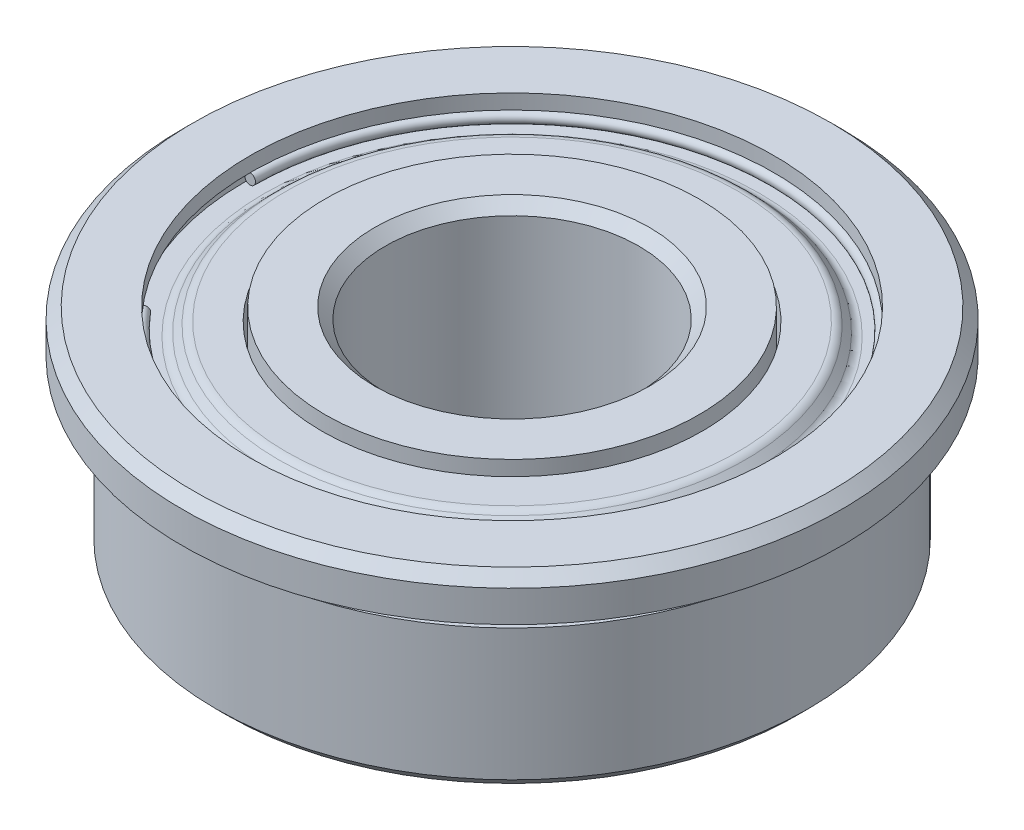
ISO-10303-21;
HEADER;
FILE_DESCRIPTION(('STEP AP214'),'2;1');
FILE_NAME('part.step','',(''),(''),'','','');
FILE_SCHEMA(('AUTOMOTIVE_DESIGN { 1 0 10303 214 1 1 1 1 }'));
ENDSEC;
DATA;
#1=APPLICATION_CONTEXT('core data for automotive mechanical design processes');
#2=APPLICATION_PROTOCOL_DEFINITION('international standard','automotive_design',2000,#1);
#3=PRODUCT_CONTEXT('',#1,'mechanical');
#4=PRODUCT('Part','Part','',(#3));
#5=PRODUCT_RELATED_PRODUCT_CATEGORY('part','',(#4));
#6=PRODUCT_DEFINITION_FORMATION('','',#4);
#7=PRODUCT_DEFINITION_CONTEXT('part definition',#1,'design');
#8=PRODUCT_DEFINITION('design','',#6,#7);
#9=PRODUCT_DEFINITION_SHAPE('','',#8);
#10=(LENGTH_UNIT() NAMED_UNIT(*) SI_UNIT(.MILLI.,.METRE.));
#11=(NAMED_UNIT(*) PLANE_ANGLE_UNIT() SI_UNIT($,.RADIAN.));
#12=(NAMED_UNIT(*) SI_UNIT($,.STERADIAN.) SOLID_ANGLE_UNIT());
#13=UNCERTAINTY_MEASURE_WITH_UNIT(LENGTH_MEASURE(1.E-05),#10,'distance_accuracy_value','');
#14=(GEOMETRIC_REPRESENTATION_CONTEXT(3) GLOBAL_UNCERTAINTY_ASSIGNED_CONTEXT((#13)) GLOBAL_UNIT_ASSIGNED_CONTEXT((#10,
#11,#12)) REPRESENTATION_CONTEXT('',''));
#15=CARTESIAN_POINT('',(0.,0.,0.));
#16=DIRECTION('',(0.,0.,1.));
#17=DIRECTION('',(1.,0.,0.));
#18=AXIS2_PLACEMENT_3D('',#15,#16,#17);
#19=CARTESIAN_POINT('',(-6.2,0.431800000000002,0.));
#20=DIRECTION('',(0.,0.,1.));
#21=DIRECTION('',(1.,0.,0.));
#22=AXIS2_PLACEMENT_3D('',#19,#20,#21);
#23=PLANE('',#22);
#24=CARTESIAN_POINT('',(-6.073,0.431800000000002,0.));
#25=CARTESIAN_POINT('',(-6.07300899992696,0.417569642926092,0.));
#26=CARTESIAN_POINT('',(-6.07543449231307,0.403251719708381,0.));
#27=CARTESIAN_POINT('',(-6.08488379429475,0.376272860189244,0.));
#28=CARTESIAN_POINT('',(-6.09190760389031,0.363611923887818,0.));
#29=CARTESIAN_POINT('',(-6.10975126434134,0.341316101747298,0.));
#30=CARTESIAN_POINT('',(-6.1205711151969,0.331681215908281,0.));
#31=CARTESIAN_POINT('',(-6.14478979269765,0.316539316925007,0.));
#32=CARTESIAN_POINT('',(-6.15818861934284,0.311032303780751,0.));
#33=CARTESIAN_POINT('',(-6.18605386450994,0.304763137356642,0.));
#34=CARTESIAN_POINT('',(-6.20052028303185,0.304000984076788,0.));
#35=CARTESIAN_POINT('',(-6.22889001376166,0.307307449590691,0.));
#36=CARTESIAN_POINT('',(-6.24279332596954,0.311376068384447,0.));
#37=CARTESIAN_POINT('',(-6.26846899590067,0.323889318093972,0.));
#38=CARTESIAN_POINT('',(-6.2802413536239,0.332333949009741,0.));
#39=CARTESIAN_POINT('',(-6.30032901054135,0.35263138586272,0.));
#40=CARTESIAN_POINT('',(-6.30864430973557,0.36448419179993,0.));
#41=CARTESIAN_POINT('',(-6.32087615792845,0.390320794880103,0.));
#42=CARTESIAN_POINT('',(-6.32479270692711,0.404304592023067,0.));
#43=CARTESIAN_POINT('',(-6.32676833023764,0.422889694465366,0.));
#44=CARTESIAN_POINT('',(-6.32700282036117,0.427340547537076,0.));
#45=CARTESIAN_POINT('',(-6.32699100007304,0.446030357073912,0.));
#46=CARTESIAN_POINT('',(-6.32456550768693,0.460348280291623,0.));
#47=CARTESIAN_POINT('',(-6.31511620570525,0.48732713981076,0.));
#48=CARTESIAN_POINT('',(-6.30809239610969,0.499988076112186,0.));
#49=CARTESIAN_POINT('',(-6.29024873565866,0.522283898252706,0.));
#50=CARTESIAN_POINT('',(-6.27942888480311,0.531918784091724,0.));
#51=CARTESIAN_POINT('',(-6.25521020730236,0.547060683074997,0.));
#52=CARTESIAN_POINT('',(-6.24181138065717,0.552567696219253,0.));
#53=CARTESIAN_POINT('',(-6.21394613549006,0.558836862643363,0.));
#54=CARTESIAN_POINT('',(-6.19947971696815,0.559599015923216,0.));
#55=CARTESIAN_POINT('',(-6.17110998623835,0.556292550409314,0.));
#56=CARTESIAN_POINT('',(-6.15720667403046,0.552223931615557,0.));
#57=CARTESIAN_POINT('',(-6.13153100409934,0.539710681906032,0.));
#58=CARTESIAN_POINT('',(-6.1197586463761,0.531266050990263,0.));
#59=CARTESIAN_POINT('',(-6.09967098945865,0.510968614137284,0.));
#60=CARTESIAN_POINT('',(-6.09135569026443,0.499115808200074,0.));
#61=CARTESIAN_POINT('',(-6.07912384207156,0.473279205119901,0.));
#62=CARTESIAN_POINT('',(-6.0752072930729,0.459295407976938,0.));
#63=CARTESIAN_POINT('',(-6.07323166976236,0.440710305534639,0.));
#64=CARTESIAN_POINT('',(-6.07299717963884,0.436259452462929,0.));
#65=CARTESIAN_POINT('',(-6.073,0.431800000000002,0.));
#66=B_SPLINE_CURVE_WITH_KNOTS('',3,(#24,#25,#26,#27,#28,#29,#30,#31,#32,#33,#34,#35,#36,#37,#38,
#39,#40,#41,#42,#43,#44,#45,#46,#47,#48,#49,#50,#51,#52,#53,#54,#55,#56,#57,#58,#59,#60,#61,#62,
#63,#64,#65),.UNSPECIFIED.,.T.,.F.,(4,2,2,2,2,2,2,2,2,2,2,2,2,2,2,2,2,2,2,2,4),(0.,
0.0426429642402332,0.0852859284804665,0.127928892721776,0.170571856963085,0.213214821204395,
0.255857785445704,0.298500749687013,0.341143713928322,0.383786678169631,0.397149959984692,
0.439792924224925,0.482435888465158,0.525078852706467,0.567721816947776,0.610364781189086,
0.653007745430395,0.695650709671705,0.738293673913014,0.780936638154322,0.794299919969383),.UNSPECIFIED.);
#67=CARTESIAN_POINT('',(-6.073,0.431800000000002,0.));
#68=VERTEX_POINT('',#67);
#69=EDGE_CURVE('P0_E18',#68,#68,#66,.T.);
#70=ORIENTED_EDGE('',*,*,#69,.F.);
#71=EDGE_LOOP('',(#70));
#72=FACE_BOUND('',#71,.T.);
#73=ADVANCED_FACE('P0_F14',(#72),#23,.T.);
#74=CARTESIAN_POINT('',(-4.74947554733771,0.431800000000002,3.98528318005649));
#75=DIRECTION('',(0.64278760968653,0.,0.766044443118986));
#76=DIRECTION('',(0.766044443118986,0.,-0.64278760968653));
#77=AXIS2_PLACEMENT_3D('',#74,#75,#76);
#78=PLANE('',#77);
#79=CARTESIAN_POINT('',(-4.84676319161383,0.431800000000002,4.06691720648668));
#80=CARTESIAN_POINT('',(-4.84675629726979,0.417569642926092,4.06691142144514));
#81=CARTESIAN_POINT('',(-4.84489826230558,0.403251719708381,4.06535234499196));
#82=CARTESIAN_POINT('',(-4.83765967703116,0.376272860189244,4.05927845075795));
#83=CARTESIAN_POINT('',(-4.83227912672096,0.363611923887819,4.05476363297712));
#84=CARTESIAN_POINT('',(-4.81861008978755,0.341316101747299,4.04329394912775));
#85=CARTESIAN_POINT('',(-4.81032160316427,0.331681215908281,4.03633908305914));
#86=CARTESIAN_POINT('',(-4.79176901984513,0.316539316925007,4.02077161723867));
#87=CARTESIAN_POINT('',(-4.78150492314927,0.311032303780751,4.0121590174868));
#88=CARTESIAN_POINT('',(-4.76015890693286,0.304763137356642,3.99424758315251));
#89=CARTESIAN_POINT('',(-4.74907698741231,0.304000984076788,3.98494874857008));
#90=CARTESIAN_POINT('',(-4.72734451283397,0.307307449590691,3.96671303716682));
#91=CARTESIAN_POINT('',(-4.71669395777617,0.311376068384447,3.95777616034599));
#92=CARTESIAN_POINT('',(-4.69702525350207,0.323889318093972,3.94127215784386));
#93=CARTESIAN_POINT('',(-4.68800710428578,0.332333949009742,3.93370503216257));
#94=CARTESIAN_POINT('',(-4.67261906632888,0.352631385862721,3.9207929351884));
#95=CARTESIAN_POINT('',(-4.66624917758828,0.36448419179993,3.91544796389552));
#96=CARTESIAN_POINT('',(-4.65687903825105,0.390320794880103,3.90758548343357));
#97=CARTESIAN_POINT('',(-4.65387878765443,0.404304592023067,3.9050679742645));
#98=CARTESIAN_POINT('',(-4.6523653723957,0.422889694465366,3.90379806807908));
#99=CARTESIAN_POINT('',(-4.6521857425396,0.427340547537076,3.90364734073309));
#100=CARTESIAN_POINT('',(-4.65219479740564,0.446030357073912,3.90365493866783));
#101=CARTESIAN_POINT('',(-4.65405283236985,0.460348280291623,3.90521401512102));
#102=CARTESIAN_POINT('',(-4.66129141764427,0.48732713981076,3.91128790935503));
#103=CARTESIAN_POINT('',(-4.66667196795447,0.499988076112186,3.91580272713585));
#104=CARTESIAN_POINT('',(-4.68034100488788,0.522283898252706,3.92727241098522));
#105=CARTESIAN_POINT('',(-4.68862949151116,0.531918784091723,3.93422727705383));
#106=CARTESIAN_POINT('',(-4.7071820748303,0.547060683074997,3.94979474287431));
#107=CARTESIAN_POINT('',(-4.71744617152616,0.552567696219253,3.95840734262617));
#108=CARTESIAN_POINT('',(-4.73879218774257,0.558836862643363,3.97631877696047));
#109=CARTESIAN_POINT('',(-4.74987410726311,0.559599015923216,3.98561761154289));
#110=CARTESIAN_POINT('',(-4.77160658184146,0.556292550409314,4.00385332294615));
#111=CARTESIAN_POINT('',(-4.78225713689926,0.552223931615557,4.01279019976699));
#112=CARTESIAN_POINT('',(-4.80192584117335,0.539710681906032,4.02929420226911));
#113=CARTESIAN_POINT('',(-4.81094399038965,0.531266050990263,4.03686132795041));
#114=CARTESIAN_POINT('',(-4.82633202834654,0.510968614137284,4.04977342492458));
#115=CARTESIAN_POINT('',(-4.83270191708715,0.499115808200074,4.05511839621746));
#116=CARTESIAN_POINT('',(-4.84207205642437,0.473279205119901,4.0629808766794));
#117=CARTESIAN_POINT('',(-4.845072307021,0.459295407976938,4.06549838584847));
#118=CARTESIAN_POINT('',(-4.84658572227973,0.440710305534639,4.06676829203389));
#119=CARTESIAN_POINT('',(-4.84676535213582,0.436259452462929,4.06691901937989));
#120=CARTESIAN_POINT('',(-4.84676319161383,0.431800000000002,4.06691720648668));
#121=B_SPLINE_CURVE_WITH_KNOTS('',3,(#79,#80,#81,#82,#83,#84,#85,#86,#87,#88,#89,#90,#91,#92,
#93,#94,#95,#96,#97,#98,#99,#100,#101,#102,#103,#104,#105,#106,#107,#108,#109,#110,#111,#112,
#113,#114,#115,#116,#117,#118,#119,#120),.UNSPECIFIED.,.T.,.F.,(4,2,2,2,2,2,2,2,2,2,2,2,2,2,2,2,
2,2,2,2,4),(0.,0.0426429642402333,0.0852859284804668,0.127928892721776,0.170571856963085,
0.213214821204395,0.255857785445705,0.298500749687014,0.341143713928322,0.383786678169631,
0.397149959984691,0.439792924224925,0.482435888465158,0.525078852706467,0.567721816947775,
0.610364781189085,0.653007745430396,0.695650709671705,0.738293673913015,0.780936638154323,
0.794299919969383),.UNSPECIFIED.);
#122=CARTESIAN_POINT('',(-4.84676319161383,0.431800000000002,4.06691720648668));
#123=VERTEX_POINT('',#122);
#124=EDGE_CURVE('P0_E9',#123,#123,#121,.T.);
#125=ORIENTED_EDGE('',*,*,#124,.F.);
#126=EDGE_LOOP('',(#125));
#127=FACE_BOUND('',#126,.T.);
#128=ADVANCED_FACE('P0_F32',(#127),#78,.F.);
#129=CARTESIAN_POINT('',(0.,0.431800000000002,0.));
#130=DIRECTION('',(0.,-1.,0.));
#131=DIRECTION('',(0.,0.,1.));
#132=AXIS2_PLACEMENT_3D('',#129,#130,#131);
#133=TOROIDAL_SURFACE('',#132,6.2,0.127000000000001);
#134=ORIENTED_EDGE('',*,*,#124,.T.);
#135=EDGE_LOOP('',(#134));
#136=FACE_BOUND('',#135,.T.);
#137=ORIENTED_EDGE('',*,*,#69,.T.);
#138=EDGE_LOOP('',(#137));
#139=FACE_BOUND('',#138,.T.);
#140=ADVANCED_FACE('P0_F34',(#136,#139),#133,.T.);
#141=CLOSED_SHELL('',(#73,#128,#140));
#142=MANIFOLD_SOLID_BREP('P0_B1',#141);
#143=CARTESIAN_POINT('',(0.,5.,0.));
#144=DIRECTION('',(0.,1.,0.));
#145=DIRECTION('',(0.,0.,1.));
#146=AXIS2_PLACEMENT_3D('',#143,#144,#145);
#147=PLANE('',#146);
#148=CARTESIAN_POINT('',(0.,5.,0.));
#149=DIRECTION('',(0.,1.,0.));
#150=DIRECTION('',(0.,0.,1.));
#151=AXIS2_PLACEMENT_3D('',#148,#149,#150);
#152=CIRCLE('',#151,4.425);
#153=CARTESIAN_POINT('',(0.,5.,4.425));
#154=VERTEX_POINT('',#153);
#155=EDGE_CURVE('P1_E380',#154,#154,#152,.F.);
#156=ORIENTED_EDGE('',*,*,#155,.F.);
#157=EDGE_LOOP('',(#156));
#158=FACE_BOUND('',#157,.T.);
#159=CARTESIAN_POINT('',(0.,5.0000000000523,0.));
#160=DIRECTION('',(0.,1.,0.));
#161=DIRECTION('',(0.,0.,1.));
#162=AXIS2_PLACEMENT_3D('',#159,#160,#161);
#163=CIRCLE('',#162,3.25399999996989);
#164=CARTESIAN_POINT('',(0.,5.0000000000523,3.25399999996989));
#165=VERTEX_POINT('',#164);
#166=EDGE_CURVE('P1_E378',#165,#165,#163,.F.);
#167=ORIENTED_EDGE('',*,*,#166,.T.);
#168=EDGE_LOOP('',(#167));
#169=FACE_BOUND('',#168,.T.);
#170=ADVANCED_FACE('P1_F17',(#158,#169),#147,.T.);
#171=CARTESIAN_POINT('',(0.,4.7,0.));
#172=DIRECTION('',(0.,1.,0.));
#173=DIRECTION('',(0.,0.,1.));
#174=AXIS2_PLACEMENT_3D('',#171,#172,#173);
#175=CYLINDRICAL_SURFACE('',#174,4.425);
#176=CARTESIAN_POINT('',(0.,3.43,0.));
#177=DIRECTION('',(0.,1.,0.));
#178=DIRECTION('',(0.,0.,1.));
#179=AXIS2_PLACEMENT_3D('',#176,#177,#178);
#180=CIRCLE('',#179,4.425);
#181=CARTESIAN_POINT('',(0.,3.43,4.425));
#182=VERTEX_POINT('',#181);
#183=EDGE_CURVE('P1_E375',#182,#182,#180,.F.);
#184=ORIENTED_EDGE('',*,*,#183,.F.);
#185=EDGE_LOOP('',(#184));
#186=FACE_BOUND('',#185,.T.);
#187=ORIENTED_EDGE('',*,*,#155,.T.);
#188=EDGE_LOOP('',(#187));
#189=FACE_BOUND('',#188,.T.);
#190=ADVANCED_FACE('P1_F128',(#186,#189),#175,.T.);
#191=CARTESIAN_POINT('',(0.,5.0000000000523,0.));
#192=DIRECTION('',(0.,1.,0.));
#193=DIRECTION('',(0.,0.,1.));
#194=AXIS2_PLACEMENT_3D('',#191,#192,#193);
#195=CONICAL_SURFACE('',#194,3.25399999996989,0.785398163397448);
#196=ORIENTED_EDGE('',*,*,#166,.F.);
#197=EDGE_LOOP('',(#196));
#198=FACE_BOUND('',#197,.T.);
#199=CARTESIAN_POINT('',(0.,4.746,0.));
#200=DIRECTION('',(0.,1.,0.));
#201=DIRECTION('',(0.,0.,1.));
#202=AXIS2_PLACEMENT_3D('',#199,#200,#201);
#203=CIRCLE('',#202,3.);
#204=CARTESIAN_POINT('',(0.,4.746,3.));
#205=VERTEX_POINT('',#204);
#206=EDGE_CURVE('P1_E374',#205,#205,#203,.F.);
#207=ORIENTED_EDGE('',*,*,#206,.T.);
#208=EDGE_LOOP('',(#207));
#209=FACE_BOUND('',#208,.T.);
#210=ADVANCED_FACE('P1_F125',(#198,#209),#195,.F.);
#211=CARTESIAN_POINT('',(0.,3.43,0.));
#212=DIRECTION('',(0.,1.,0.));
#213=DIRECTION('',(0.,0.,1.));
#214=AXIS2_PLACEMENT_3D('',#211,#212,#213);
#215=PLANE('',#214);
#216=CARTESIAN_POINT('',(0.,3.43,0.));
#217=DIRECTION('',(0.,1.,0.));
#218=DIRECTION('',(0.,0.,1.));
#219=AXIS2_PLACEMENT_3D('',#216,#217,#218);
#220=CIRCLE('',#219,4.5012);
#221=CARTESIAN_POINT('',(0.,3.43,4.5012));
#222=VERTEX_POINT('',#221);
#223=EDGE_CURVE('P1_E371',#222,#222,#220,.T.);
#224=ORIENTED_EDGE('',*,*,#223,.T.);
#225=EDGE_LOOP('',(#224));
#226=FACE_BOUND('',#225,.T.);
#227=ORIENTED_EDGE('',*,*,#183,.T.);
#228=EDGE_LOOP('',(#227));
#229=FACE_BOUND('',#228,.T.);
#230=ADVANCED_FACE('P1_F121',(#226,#229),#215,.T.);
#231=CARTESIAN_POINT('',(0.,0.,0.));
#232=DIRECTION('',(0.,1.,0.));
#233=DIRECTION('',(0.,0.,1.));
#234=AXIS2_PLACEMENT_3D('',#231,#232,#233);
#235=CYLINDRICAL_SURFACE('',#234,3.);
#236=ORIENTED_EDGE('',*,*,#206,.F.);
#237=EDGE_LOOP('',(#236));
#238=FACE_BOUND('',#237,.T.);
#239=CARTESIAN_POINT('',(0.,0.253999999983989,0.));
#240=DIRECTION('',(0.,-1.,0.));
#241=DIRECTION('',(0.,0.,-1.));
#242=AXIS2_PLACEMENT_3D('',#239,#240,#241);
#243=CIRCLE('',#242,3.00000000004275);
#244=CARTESIAN_POINT('',(0.,0.253999999983989,-3.00000000004275));
#245=VERTEX_POINT('',#244);
#246=EDGE_CURVE('P1_E78',#245,#245,#243,.T.);
#247=ORIENTED_EDGE('',*,*,#246,.T.);
#248=EDGE_LOOP('',(#247));
#249=FACE_BOUND('',#248,.T.);
#250=ADVANCED_FACE('P1_F117',(#238,#249),#235,.F.);
#251=CARTESIAN_POINT('',(0.,3.43,0.));
#252=DIRECTION('',(0.,1.,0.));
#253=DIRECTION('',(0.,0.,1.));
#254=AXIS2_PLACEMENT_3D('',#251,#252,#253);
#255=CYLINDRICAL_SURFACE('',#254,4.5012);
#256=CARTESIAN_POINT('',(0.,4.7,0.));
#257=DIRECTION('',(0.,1.,0.));
#258=DIRECTION('',(0.,0.,1.));
#259=AXIS2_PLACEMENT_3D('',#256,#257,#258);
#260=CIRCLE('',#259,4.5012);
#261=CARTESIAN_POINT('',(0.,4.7,4.5012));
#262=VERTEX_POINT('',#261);
#263=EDGE_CURVE('P1_E368',#262,#262,#260,.F.);
#264=ORIENTED_EDGE('',*,*,#263,.F.);
#265=EDGE_LOOP('',(#264));
#266=FACE_BOUND('',#265,.T.);
#267=ORIENTED_EDGE('',*,*,#223,.F.);
#268=EDGE_LOOP('',(#267));
#269=FACE_BOUND('',#268,.T.);
#270=ADVANCED_FACE('P1_F113',(#266,#269),#255,.F.);
#271=CARTESIAN_POINT('',(0.,-5.6843418860808E-11,0.));
#272=DIRECTION('',(0.,-1.,0.));
#273=DIRECTION('',(0.,0.,-1.));
#274=AXIS2_PLACEMENT_3D('',#271,#272,#273);
#275=CONICAL_SURFACE('',#274,3.25400000008358,0.785398163397448);
#276=CARTESIAN_POINT('',(0.,0.,0.));
#277=DIRECTION('',(0.,-1.,0.));
#278=DIRECTION('',(0.,0.,-1.));
#279=AXIS2_PLACEMENT_3D('',#276,#277,#278);
#280=CIRCLE('',#279,3.25400000002674);
#281=CARTESIAN_POINT('',(0.,0.,-3.25400000002674));
#282=VERTEX_POINT('',#281);
#283=EDGE_CURVE('P1_E64',#282,#282,#280,.T.);
#284=ORIENTED_EDGE('',*,*,#283,.T.);
#285=EDGE_LOOP('',(#284));
#286=FACE_BOUND('',#285,.T.);
#287=ORIENTED_EDGE('',*,*,#246,.F.);
#288=EDGE_LOOP('',(#287));
#289=FACE_BOUND('',#288,.T.);
#290=ADVANCED_FACE('P1_F108',(#286,#289),#275,.F.);
#291=CARTESIAN_POINT('',(0.,4.7,0.));
#292=DIRECTION('',(0.,1.,0.));
#293=DIRECTION('',(0.,0.,1.));
#294=AXIS2_PLACEMENT_3D('',#291,#292,#293);
#295=PLANE('',#294);
#296=ORIENTED_EDGE('',*,*,#263,.T.);
#297=EDGE_LOOP('',(#296));
#298=FACE_BOUND('',#297,.T.);
#299=CARTESIAN_POINT('',(0.,4.7,0.));
#300=DIRECTION('',(0.,-1.,0.));
#301=DIRECTION('',(0.,0.,-1.));
#302=AXIS2_PLACEMENT_3D('',#299,#300,#301);
#303=CIRCLE('',#302,5.34478975515724);
#304=CARTESIAN_POINT('',(0.,4.7,-5.34478975515724));
#305=VERTEX_POINT('',#304);
#306=CARTESIAN_POINT('',(0.,4.7,5.34478975515724));
#307=VERTEX_POINT('',#306);
#308=EDGE_CURVE('P1_E62',#305,#307,#303,.T.);
#309=ORIENTED_EDGE('',*,*,#308,.F.);
#310=CARTESIAN_POINT('',(0.,4.7,0.));
#311=DIRECTION('',(0.,-1.,0.));
#312=DIRECTION('',(0.,0.,1.));
#313=AXIS2_PLACEMENT_3D('',#310,#311,#312);
#314=CIRCLE('',#313,5.34478975515724);
#315=EDGE_CURVE('P1_E57',#307,#305,#314,.T.);
#316=ORIENTED_EDGE('',*,*,#315,.F.);
#317=EDGE_LOOP('',(#309,#316));
#318=FACE_BOUND('',#317,.T.);
#319=ADVANCED_FACE('P1_F61',(#298,#318),#295,.T.);
#320=CARTESIAN_POINT('',(0.,0.,0.));
#321=DIRECTION('',(0.,1.,0.));
#322=DIRECTION('',(0.,0.,1.));
#323=AXIS2_PLACEMENT_3D('',#320,#321,#322);
#324=PLANE('',#323);
#325=CARTESIAN_POINT('',(0.,0.,0.));
#326=DIRECTION('',(0.,-1.,0.));
#327=DIRECTION('',(0.,0.,-1.));
#328=AXIS2_PLACEMENT_3D('',#325,#326,#327);
#329=CIRCLE('',#328,4.425);
#330=CARTESIAN_POINT('',(0.,0.,-4.425));
#331=VERTEX_POINT('',#330);
#332=EDGE_CURVE('P1_E70',#331,#331,#329,.F.);
#333=ORIENTED_EDGE('',*,*,#332,.F.);
#334=EDGE_LOOP('',(#333));
#335=FACE_BOUND('',#334,.T.);
#336=ORIENTED_EDGE('',*,*,#283,.F.);
#337=EDGE_LOOP('',(#336));
#338=FACE_BOUND('',#337,.T.);
#339=ADVANCED_FACE('P1_F91',(#335,#338),#324,.F.);
#340=CARTESIAN_POINT('',(0.,4.446,0.));
#341=DIRECTION('',(0.,1.,0.));
#342=DIRECTION('',(0.,0.,1.));
#343=AXIS2_PLACEMENT_3D('',#340,#341,#342);
#344=TOROIDAL_SURFACE('',#343,5.34478975515723,0.254);
#345=ORIENTED_EDGE('',*,*,#315,.T.);
#346=ORIENTED_EDGE('',*,*,#308,.T.);
#347=EDGE_LOOP('',(#345,#346));
#348=FACE_BOUND('',#347,.T.);
#349=CARTESIAN_POINT('',(0.,4.62560512232812,0.));
#350=DIRECTION('',(0.,-1.,0.));
#351=DIRECTION('',(0.,0.,-1.));
#352=AXIS2_PLACEMENT_3D('',#349,#350,#351);
#353=CIRCLE('',#352,5.52439487756828);
#354=CARTESIAN_POINT('',(0.,4.62560512232812,-5.52439487756828));
#355=VERTEX_POINT('',#354);
#356=EDGE_CURVE('P1_E96',#355,#355,#353,.T.);
#357=ORIENTED_EDGE('',*,*,#356,.F.);
#358=EDGE_LOOP('',(#357));
#359=FACE_BOUND('',#358,.T.);
#360=ADVANCED_FACE('P1_F68',(#348,#359),#344,.T.);
#361=CARTESIAN_POINT('',(0.,0.254,0.));
#362=DIRECTION('',(0.,-1.,0.));
#363=DIRECTION('',(0.,0.,-1.));
#364=AXIS2_PLACEMENT_3D('',#361,#362,#363);
#365=CYLINDRICAL_SURFACE('',#364,4.425);
#366=ORIENTED_EDGE('',*,*,#332,.T.);
#367=EDGE_LOOP('',(#366));
#368=FACE_BOUND('',#367,.T.);
#369=CARTESIAN_POINT('',(0.,1.524,0.));
#370=DIRECTION('',(0.,-1.,0.));
#371=DIRECTION('',(0.,0.,-1.));
#372=AXIS2_PLACEMENT_3D('',#369,#370,#371);
#373=CIRCLE('',#372,4.425);
#374=CARTESIAN_POINT('',(0.,1.524,-4.425));
#375=VERTEX_POINT('',#374);
#376=EDGE_CURVE('P1_E352',#375,#375,#373,.F.);
#377=ORIENTED_EDGE('',*,*,#376,.F.);
#378=EDGE_LOOP('',(#377));
#379=FACE_BOUND('',#378,.T.);
#380=ADVANCED_FACE('P1_F90',(#368,#379),#365,.T.);
#381=CARTESIAN_POINT('',(0.,4.46959487754839,0.));
#382=DIRECTION('',(0.,-1.,0.));
#383=DIRECTION('',(0.,0.,-1.));
#384=AXIS2_PLACEMENT_3D('',#381,#382,#383);
#385=CONICAL_SURFACE('',#384,5.68040512234802,0.785398163397448);
#386=CARTESIAN_POINT('',(0.,4.46959487757862,0.));
#387=DIRECTION('',(0.,-1.,0.));
#388=DIRECTION('',(0.,0.,-1.));
#389=AXIS2_PLACEMENT_3D('',#386,#387,#388);
#390=CIRCLE('',#389,5.68040512242138);
#391=CARTESIAN_POINT('',(0.,4.46959487757862,-5.68040512242138));
#392=VERTEX_POINT('',#391);
#393=EDGE_CURVE('P1_E344',#392,#392,#390,.F.);
#394=ORIENTED_EDGE('',*,*,#393,.T.);
#395=EDGE_LOOP('',(#394));
#396=FACE_BOUND('',#395,.T.);
#397=ORIENTED_EDGE('',*,*,#356,.T.);
#398=EDGE_LOOP('',(#397));
#399=FACE_BOUND('',#398,.T.);
#400=ADVANCED_FACE('P1_F445',(#396,#399),#385,.T.);
#401=CARTESIAN_POINT('',(0.,1.524,0.));
#402=DIRECTION('',(0.,-1.,0.));
#403=DIRECTION('',(0.,0.,-1.));
#404=AXIS2_PLACEMENT_3D('',#401,#402,#403);
#405=PLANE('',#404);
#406=ORIENTED_EDGE('',*,*,#376,.T.);
#407=EDGE_LOOP('',(#406));
#408=FACE_BOUND('',#407,.T.);
#409=CARTESIAN_POINT('',(0.,1.524,0.));
#410=DIRECTION('',(0.,-1.,0.));
#411=DIRECTION('',(0.,0.,-1.));
#412=AXIS2_PLACEMENT_3D('',#409,#410,#411);
#413=CIRCLE('',#412,4.5012);
#414=CARTESIAN_POINT('',(0.,1.524,-4.5012));
#415=VERTEX_POINT('',#414);
#416=EDGE_CURVE('P1_E351',#415,#415,#413,.T.);
#417=ORIENTED_EDGE('',*,*,#416,.T.);
#418=EDGE_LOOP('',(#417));
#419=FACE_BOUND('',#418,.T.);
#420=ADVANCED_FACE('P1_F332',(#408,#419),#405,.T.);
#421=CARTESIAN_POINT('',(0.,4.6492,0.));
#422=DIRECTION('',(0.,-1.,0.));
#423=DIRECTION('',(0.,0.,-1.));
#424=AXIS2_PLACEMENT_3D('',#421,#422,#423);
#425=TOROIDAL_SURFACE('',#424,5.86001024484276,0.254);
#426=CARTESIAN_POINT('',(0.,4.3952,0.));
#427=DIRECTION('',(0.,1.,0.));
#428=DIRECTION('',(0.,0.,1.));
#429=AXIS2_PLACEMENT_3D('',#426,#427,#428);
#430=CIRCLE('',#429,5.86001024484276);
#431=CARTESIAN_POINT('',(0.,4.3952,5.86001024484276));
#432=VERTEX_POINT('',#431);
#433=CARTESIAN_POINT('',(0.,4.3952,-5.86001024484276));
#434=VERTEX_POINT('',#433);
#435=EDGE_CURVE('P1_E314',#432,#434,#430,.T.);
#436=ORIENTED_EDGE('',*,*,#435,.T.);
#437=CARTESIAN_POINT('',(0.,4.3952,0.));
#438=DIRECTION('',(0.,1.,0.));
#439=DIRECTION('',(0.,0.,-1.));
#440=AXIS2_PLACEMENT_3D('',#437,#438,#439);
#441=CIRCLE('',#440,5.86001024484276);
#442=EDGE_CURVE('P1_E304',#434,#432,#441,.T.);
#443=ORIENTED_EDGE('',*,*,#442,.T.);
#444=EDGE_LOOP('',(#436,#443));
#445=FACE_BOUND('',#444,.T.);
#446=ORIENTED_EDGE('',*,*,#393,.F.);
#447=EDGE_LOOP('',(#446));
#448=FACE_BOUND('',#447,.T.);
#449=ADVANCED_FACE('P1_F327',(#445,#448),#425,.F.);
#450=CARTESIAN_POINT('',(0.,1.524,0.));
#451=DIRECTION('',(0.,-1.,0.));
#452=DIRECTION('',(0.,0.,-1.));
#453=AXIS2_PLACEMENT_3D('',#450,#451,#452);
#454=CYLINDRICAL_SURFACE('',#453,4.5012);
#455=ORIENTED_EDGE('',*,*,#416,.F.);
#456=EDGE_LOOP('',(#455));
#457=FACE_BOUND('',#456,.T.);
#458=CARTESIAN_POINT('',(0.,0.254,0.));
#459=DIRECTION('',(0.,-1.,0.));
#460=DIRECTION('',(0.,0.,-1.));
#461=AXIS2_PLACEMENT_3D('',#458,#459,#460);
#462=CIRCLE('',#461,4.5012);
#463=CARTESIAN_POINT('',(0.,0.254,-4.5012));
#464=VERTEX_POINT('',#463);
#465=EDGE_CURVE('P1_E431',#464,#464,#462,.F.);
#466=ORIENTED_EDGE('',*,*,#465,.F.);
#467=EDGE_LOOP('',(#466));
#468=FACE_BOUND('',#467,.T.);
#469=ADVANCED_FACE('P1_F331',(#457,#468),#454,.F.);
#470=CARTESIAN_POINT('',(0.,4.3952,6.2));
#471=DIRECTION('',(0.,-1.,0.));
#472=DIRECTION('',(0.,0.,-1.));
#473=AXIS2_PLACEMENT_3D('',#470,#471,#472);
#474=PLANE('',#473);
#475=CARTESIAN_POINT('',(0.,4.3952,0.));
#476=DIRECTION('',(0.,1.,0.));
#477=DIRECTION('',(0.,0.,1.));
#478=AXIS2_PLACEMENT_3D('',#475,#476,#477);
#479=CIRCLE('',#478,6.327);
#480=CARTESIAN_POINT('',(0.,4.3952,6.327));
#481=VERTEX_POINT('',#480);
#482=EDGE_CURVE('P1_E429',#481,#481,#479,.T.);
#483=ORIENTED_EDGE('',*,*,#482,.T.);
#484=EDGE_LOOP('',(#483));
#485=FACE_BOUND('',#484,.T.);
#486=ORIENTED_EDGE('',*,*,#442,.F.);
#487=ORIENTED_EDGE('',*,*,#435,.F.);
#488=EDGE_LOOP('',(#486,#487));
#489=FACE_BOUND('',#488,.T.);
#490=ADVANCED_FACE('P1_F279',(#485,#489),#474,.F.);
#491=CARTESIAN_POINT('',(0.,0.254,0.));
#492=DIRECTION('',(0.,-1.,0.));
#493=DIRECTION('',(0.,0.,-1.));
#494=AXIS2_PLACEMENT_3D('',#491,#492,#493);
#495=PLANE('',#494);
#496=ORIENTED_EDGE('',*,*,#465,.T.);
#497=EDGE_LOOP('',(#496));
#498=FACE_BOUND('',#497,.T.);
#499=CARTESIAN_POINT('',(0.,0.254,0.));
#500=DIRECTION('',(0.,1.,0.));
#501=DIRECTION('',(0.,0.,1.));
#502=AXIS2_PLACEMENT_3D('',#499,#500,#501);
#503=CIRCLE('',#502,5.34478975515724);
#504=CARTESIAN_POINT('',(0.,0.254,5.34478975515724));
#505=VERTEX_POINT('',#504);
#506=CARTESIAN_POINT('',(0.,0.254,-5.34478975515724));
#507=VERTEX_POINT('',#506);
#508=EDGE_CURVE('P1_E265',#505,#507,#503,.T.);
#509=ORIENTED_EDGE('',*,*,#508,.F.);
#510=CARTESIAN_POINT('',(0.,0.254,0.));
#511=DIRECTION('',(0.,1.,0.));
#512=DIRECTION('',(0.,0.,-1.));
#513=AXIS2_PLACEMENT_3D('',#510,#511,#512);
#514=CIRCLE('',#513,5.34478975515724);
#515=EDGE_CURVE('P1_E236',#507,#505,#514,.T.);
#516=ORIENTED_EDGE('',*,*,#515,.F.);
#517=EDGE_LOOP('',(#509,#516));
#518=FACE_BOUND('',#517,.T.);
#519=ADVANCED_FACE('P1_F270',(#498,#518),#495,.T.);
#520=CARTESIAN_POINT('',(0.,0.,0.));
#521=DIRECTION('',(0.,1.,0.));
#522=DIRECTION('',(0.,0.,1.));
#523=AXIS2_PLACEMENT_3D('',#520,#521,#522);
#524=CYLINDRICAL_SURFACE('',#523,6.327);
#525=ORIENTED_EDGE('',*,*,#482,.F.);
#526=EDGE_LOOP('',(#525));
#527=FACE_BOUND('',#526,.T.);
#528=CARTESIAN_POINT('',(0.,4.6492,0.));
#529=DIRECTION('',(0.,1.,0.));
#530=DIRECTION('',(0.,0.,1.));
#531=AXIS2_PLACEMENT_3D('',#528,#529,#530);
#532=CIRCLE('',#531,6.327);
#533=CARTESIAN_POINT('',(0.,4.6492,6.327));
#534=VERTEX_POINT('',#533);
#535=EDGE_CURVE('P1_E426',#534,#534,#532,.T.);
#536=ORIENTED_EDGE('',*,*,#535,.T.);
#537=EDGE_LOOP('',(#536));
#538=FACE_BOUND('',#537,.T.);
#539=ADVANCED_FACE('P1_F255',(#527,#538),#524,.F.);
#540=CARTESIAN_POINT('',(0.,0.508,0.));
#541=DIRECTION('',(0.,-1.,0.));
#542=DIRECTION('',(0.,0.,-1.));
#543=AXIS2_PLACEMENT_3D('',#540,#541,#542);
#544=TOROIDAL_SURFACE('',#543,5.34478975515723,0.254);
#545=ORIENTED_EDGE('',*,*,#515,.T.);
#546=ORIENTED_EDGE('',*,*,#508,.T.);
#547=EDGE_LOOP('',(#545,#546));
#548=FACE_BOUND('',#547,.T.);
#549=CARTESIAN_POINT('',(0.,0.32839487766978,0.));
#550=DIRECTION('',(0.,1.,0.));
#551=DIRECTION('',(0.,0.,-1.));
#552=AXIS2_PLACEMENT_3D('',#549,#550,#551);
#553=CIRCLE('',#552,5.52439487756828);
#554=CARTESIAN_POINT('',(0.,0.32839487766978,-5.52439487756828));
#555=VERTEX_POINT('',#554);
#556=EDGE_CURVE('P1_E262',#555,#555,#553,.T.);
#557=ORIENTED_EDGE('',*,*,#556,.F.);
#558=EDGE_LOOP('',(#557));
#559=FACE_BOUND('',#558,.T.);
#560=ADVANCED_FACE('P1_F243',(#548,#559),#544,.T.);
#561=CARTESIAN_POINT('',(-6.2,4.6492,0.));
#562=DIRECTION('',(0.,1.,0.));
#563=DIRECTION('',(0.,0.,1.));
#564=AXIS2_PLACEMENT_3D('',#561,#562,#563);
#565=PLANE('',#564);
#566=CARTESIAN_POINT('',(0.,4.6492,0.));
#567=DIRECTION('',(0.,1.,0.));
#568=DIRECTION('',(0.,0.,1.));
#569=AXIS2_PLACEMENT_3D('',#566,#567,#568);
#570=CIRCLE('',#569,6.2);
#571=CARTESIAN_POINT('',(0.,4.6492,6.2));
#572=VERTEX_POINT('',#571);
#573=EDGE_CURVE('P1_E423',#572,#572,#570,.T.);
#574=ORIENTED_EDGE('',*,*,#573,.T.);
#575=EDGE_LOOP('',(#574));
#576=FACE_BOUND('',#575,.T.);
#577=ORIENTED_EDGE('',*,*,#535,.F.);
#578=EDGE_LOOP('',(#577));
#579=FACE_BOUND('',#578,.T.);
#580=ADVANCED_FACE('P1_F254',(#576,#579),#565,.F.);
#581=CARTESIAN_POINT('',(0.,0.484405122449516,0.));
#582=DIRECTION('',(0.,1.,0.));
#583=DIRECTION('',(-1.,0.,0.));
#584=AXIS2_PLACEMENT_3D('',#581,#582,#583);
#585=CONICAL_SURFACE('',#584,5.68040512234802,0.785398163397448);
#586=ORIENTED_EDGE('',*,*,#556,.T.);
#587=EDGE_LOOP('',(#586));
#588=FACE_BOUND('',#587,.T.);
#589=CARTESIAN_POINT('',(0.,0.484405122421382,0.));
#590=DIRECTION('',(0.,1.,0.));
#591=DIRECTION('',(0.,0.,1.));
#592=AXIS2_PLACEMENT_3D('',#589,#590,#591);
#593=CIRCLE('',#592,5.68040512242138);
#594=CARTESIAN_POINT('',(0.,0.484405122421382,5.68040512242138));
#595=VERTEX_POINT('',#594);
#596=EDGE_CURVE('P1_E422',#595,#595,#593,.F.);
#597=ORIENTED_EDGE('',*,*,#596,.T.);
#598=EDGE_LOOP('',(#597));
#599=FACE_BOUND('',#598,.T.);
#600=ADVANCED_FACE('P1_F537',(#588,#599),#585,.T.);
#601=CARTESIAN_POINT('',(0.,4.7,0.));
#602=DIRECTION('',(0.,1.,0.));
#603=DIRECTION('',(0.,0.,1.));
#604=AXIS2_PLACEMENT_3D('',#601,#602,#603);
#605=CYLINDRICAL_SURFACE('',#604,6.2);
#606=CARTESIAN_POINT('',(0.,5.,0.));
#607=DIRECTION('',(0.,1.,0.));
#608=DIRECTION('',(0.,0.,1.));
#609=AXIS2_PLACEMENT_3D('',#606,#607,#608);
#610=CIRCLE('',#609,6.2);
#611=CARTESIAN_POINT('',(0.,5.,6.2));
#612=VERTEX_POINT('',#611);
#613=EDGE_CURVE('P1_E419',#612,#612,#610,.F.);
#614=ORIENTED_EDGE('',*,*,#613,.F.);
#615=EDGE_LOOP('',(#614));
#616=FACE_BOUND('',#615,.T.);
#617=ORIENTED_EDGE('',*,*,#573,.F.);
#618=EDGE_LOOP('',(#617));
#619=FACE_BOUND('',#618,.T.);
#620=ADVANCED_FACE('P1_F217',(#616,#619),#605,.F.);
#621=CARTESIAN_POINT('',(0.,0.3048,0.));
#622=DIRECTION('',(0.,1.,0.));
#623=DIRECTION('',(0.,0.,1.));
#624=AXIS2_PLACEMENT_3D('',#621,#622,#623);
#625=TOROIDAL_SURFACE('',#624,5.86001024484276,0.254);
#626=CARTESIAN_POINT('',(0.,0.5588,0.));
#627=DIRECTION('',(0.,-1.,0.));
#628=DIRECTION('',(0.,0.,-1.));
#629=AXIS2_PLACEMENT_3D('',#626,#627,#628);
#630=CIRCLE('',#629,5.86001024484276);
#631=CARTESIAN_POINT('',(0.,0.5588,-5.86001024484276));
#632=VERTEX_POINT('',#631);
#633=CARTESIAN_POINT('',(0.,0.5588,5.86001024484276));
#634=VERTEX_POINT('',#633);
#635=EDGE_CURVE('P1_E418',#632,#634,#630,.T.);
#636=ORIENTED_EDGE('',*,*,#635,.T.);
#637=CARTESIAN_POINT('',(0.,0.5588,0.));
#638=DIRECTION('',(0.,-1.,0.));
#639=DIRECTION('',(0.,0.,1.));
#640=AXIS2_PLACEMENT_3D('',#637,#638,#639);
#641=CIRCLE('',#640,5.86001024484276);
#642=EDGE_CURVE('P1_E36',#634,#632,#641,.T.);
#643=ORIENTED_EDGE('',*,*,#642,.T.);
#644=EDGE_LOOP('',(#636,#643));
#645=FACE_BOUND('',#644,.T.);
#646=ORIENTED_EDGE('',*,*,#596,.F.);
#647=EDGE_LOOP('',(#646));
#648=FACE_BOUND('',#647,.T.);
#649=ADVANCED_FACE('P1_F213',(#645,#648),#625,.F.);
#650=CARTESIAN_POINT('',(0.,5.,0.));
#651=DIRECTION('',(0.,1.,0.));
#652=DIRECTION('',(0.,0.,1.));
#653=AXIS2_PLACEMENT_3D('',#650,#651,#652);
#654=PLANE('',#653);
#655=ORIENTED_EDGE('',*,*,#613,.T.);
#656=EDGE_LOOP('',(#655));
#657=FACE_BOUND('',#656,.T.);
#658=CARTESIAN_POINT('',(0.,5.,0.));
#659=DIRECTION('',(0.,-1.,0.));
#660=DIRECTION('',(0.,0.,-1.));
#661=AXIS2_PLACEMENT_3D('',#658,#659,#660);
#662=CIRCLE('',#661,7.546);
#663=CARTESIAN_POINT('',(0.,5.,-7.546));
#664=VERTEX_POINT('',#663);
#665=EDGE_CURVE('P1_E415',#664,#664,#662,.T.);
#666=ORIENTED_EDGE('',*,*,#665,.F.);
#667=EDGE_LOOP('',(#666));
#668=FACE_BOUND('',#667,.T.);
#669=ADVANCED_FACE('P1_F192',(#657,#668),#654,.T.);
#670=CARTESIAN_POINT('',(0.,0.5588,6.2));
#671=DIRECTION('',(0.,1.,0.));
#672=DIRECTION('',(0.,0.,1.));
#673=AXIS2_PLACEMENT_3D('',#670,#671,#672);
#674=PLANE('',#673);
#675=CARTESIAN_POINT('',(0.,0.558800000000003,0.));
#676=DIRECTION('',(0.,-1.,0.));
#677=DIRECTION('',(0.,0.,-1.));
#678=AXIS2_PLACEMENT_3D('',#675,#676,#677);
#679=CIRCLE('',#678,6.327);
#680=CARTESIAN_POINT('',(0.,0.558800000000003,-6.327));
#681=VERTEX_POINT('',#680);
#682=EDGE_CURVE('P1_E412',#681,#681,#679,.T.);
#683=ORIENTED_EDGE('',*,*,#682,.T.);
#684=EDGE_LOOP('',(#683));
#685=FACE_BOUND('',#684,.T.);
#686=ORIENTED_EDGE('',*,*,#642,.F.);
#687=ORIENTED_EDGE('',*,*,#635,.F.);
#688=EDGE_LOOP('',(#686,#687));
#689=FACE_BOUND('',#688,.T.);
#690=ADVANCED_FACE('P1_F187',(#685,#689),#674,.F.);
#691=CARTESIAN_POINT('',(0.,4.746,0.));
#692=DIRECTION('',(0.,-1.,0.));
#693=DIRECTION('',(0.,0.,-1.));
#694=AXIS2_PLACEMENT_3D('',#691,#692,#693);
#695=CONICAL_SURFACE('',#694,7.8,0.78539816339745);
#696=ORIENTED_EDGE('',*,*,#665,.T.);
#697=EDGE_LOOP('',(#696));
#698=FACE_BOUND('',#697,.T.);
#699=CARTESIAN_POINT('',(0.,4.746,0.));
#700=DIRECTION('',(0.,-1.,0.));
#701=DIRECTION('',(0.,0.,-1.));
#702=AXIS2_PLACEMENT_3D('',#699,#700,#701);
#703=CIRCLE('',#702,7.8);
#704=CARTESIAN_POINT('',(0.,4.746,-7.8));
#705=VERTEX_POINT('',#704);
#706=EDGE_CURVE('P1_E411',#705,#705,#703,.T.);
#707=ORIENTED_EDGE('',*,*,#706,.F.);
#708=EDGE_LOOP('',(#707));
#709=FACE_BOUND('',#708,.T.);
#710=ADVANCED_FACE('P1_F183',(#698,#709),#695,.T.);
#711=CARTESIAN_POINT('',(0.,4.954,0.));
#712=DIRECTION('',(0.,-1.,0.));
#713=DIRECTION('',(0.,0.,-1.));
#714=AXIS2_PLACEMENT_3D('',#711,#712,#713);
#715=CYLINDRICAL_SURFACE('',#714,6.327);
#716=CARTESIAN_POINT('',(0.,0.3048,0.));
#717=DIRECTION('',(0.,-1.,0.));
#718=DIRECTION('',(0.,0.,-1.));
#719=AXIS2_PLACEMENT_3D('',#716,#717,#718);
#720=CIRCLE('',#719,6.327);
#721=CARTESIAN_POINT('',(0.,0.3048,-6.327));
#722=VERTEX_POINT('',#721);
#723=EDGE_CURVE('P1_E408',#722,#722,#720,.T.);
#724=ORIENTED_EDGE('',*,*,#723,.T.);
#725=EDGE_LOOP('',(#724));
#726=FACE_BOUND('',#725,.T.);
#727=ORIENTED_EDGE('',*,*,#682,.F.);
#728=EDGE_LOOP('',(#727));
#729=FACE_BOUND('',#728,.T.);
#730=ADVANCED_FACE('P1_F179',(#726,#729),#715,.F.);
#731=CARTESIAN_POINT('',(0.,5.,0.));
#732=DIRECTION('',(0.,-1.,0.));
#733=DIRECTION('',(0.,0.,-1.));
#734=AXIS2_PLACEMENT_3D('',#731,#732,#733);
#735=CYLINDRICAL_SURFACE('',#734,7.8);
#736=ORIENTED_EDGE('',*,*,#706,.T.);
#737=EDGE_LOOP('',(#736));
#738=FACE_BOUND('',#737,.T.);
#739=CARTESIAN_POINT('',(0.,4.,0.));
#740=DIRECTION('',(0.,-1.,0.));
#741=DIRECTION('',(0.,0.,-1.));
#742=AXIS2_PLACEMENT_3D('',#739,#740,#741);
#743=CIRCLE('',#742,7.8);
#744=CARTESIAN_POINT('',(0.,4.,-7.8));
#745=VERTEX_POINT('',#744);
#746=EDGE_CURVE('P1_E405',#745,#745,#743,.F.);
#747=ORIENTED_EDGE('',*,*,#746,.T.);
#748=EDGE_LOOP('',(#747));
#749=FACE_BOUND('',#748,.T.);
#750=ADVANCED_FACE('P1_F175',(#738,#749),#735,.T.);
#751=CARTESIAN_POINT('',(-6.2,0.3048,0.));
#752=DIRECTION('',(0.,-1.,0.));
#753=DIRECTION('',(0.,0.,-1.));
#754=AXIS2_PLACEMENT_3D('',#751,#752,#753);
#755=PLANE('',#754);
#756=CARTESIAN_POINT('',(0.,0.3048,0.));
#757=DIRECTION('',(0.,-1.,0.));
#758=DIRECTION('',(0.,0.,-1.));
#759=AXIS2_PLACEMENT_3D('',#756,#757,#758);
#760=CIRCLE('',#759,6.2);
#761=CARTESIAN_POINT('',(0.,0.3048,-6.2));
#762=VERTEX_POINT('',#761);
#763=EDGE_CURVE('P1_E402',#762,#762,#760,.T.);
#764=ORIENTED_EDGE('',*,*,#763,.T.);
#765=EDGE_LOOP('',(#764));
#766=FACE_BOUND('',#765,.T.);
#767=ORIENTED_EDGE('',*,*,#723,.F.);
#768=EDGE_LOOP('',(#767));
#769=FACE_BOUND('',#768,.T.);
#770=ADVANCED_FACE('P1_F171',(#766,#769),#755,.F.);
#771=CARTESIAN_POINT('',(0.,4.,0.));
#772=DIRECTION('',(0.,1.,0.));
#773=DIRECTION('',(0.,0.,1.));
#774=AXIS2_PLACEMENT_3D('',#771,#772,#773);
#775=PLANE('',#774);
#776=CARTESIAN_POINT('',(0.,4.,0.));
#777=DIRECTION('',(0.,1.,0.));
#778=DIRECTION('',(0.,0.,1.));
#779=AXIS2_PLACEMENT_3D('',#776,#777,#778);
#780=CIRCLE('',#779,6.746);
#781=CARTESIAN_POINT('',(0.,4.,6.746));
#782=VERTEX_POINT('',#781);
#783=EDGE_CURVE('P1_E399',#782,#782,#780,.F.);
#784=ORIENTED_EDGE('',*,*,#783,.F.);
#785=EDGE_LOOP('',(#784));
#786=FACE_BOUND('',#785,.T.);
#787=ORIENTED_EDGE('',*,*,#746,.F.);
#788=EDGE_LOOP('',(#787));
#789=FACE_BOUND('',#788,.T.);
#790=ADVANCED_FACE('P1_F167',(#786,#789),#775,.F.);
#791=CARTESIAN_POINT('',(0.,0.254,0.));
#792=DIRECTION('',(0.,-1.,0.));
#793=DIRECTION('',(0.,0.,-1.));
#794=AXIS2_PLACEMENT_3D('',#791,#792,#793);
#795=CYLINDRICAL_SURFACE('',#794,6.2);
#796=ORIENTED_EDGE('',*,*,#763,.F.);
#797=EDGE_LOOP('',(#796));
#798=FACE_BOUND('',#797,.T.);
#799=CARTESIAN_POINT('',(0.,0.,0.));
#800=DIRECTION('',(0.,-1.,0.));
#801=DIRECTION('',(0.,0.,-1.));
#802=AXIS2_PLACEMENT_3D('',#799,#800,#801);
#803=CIRCLE('',#802,6.2);
#804=CARTESIAN_POINT('',(0.,0.,-6.2));
#805=VERTEX_POINT('',#804);
#806=EDGE_CURVE('P1_E396',#805,#805,#803,.T.);
#807=ORIENTED_EDGE('',*,*,#806,.T.);
#808=EDGE_LOOP('',(#807));
#809=FACE_BOUND('',#808,.T.);
#810=ADVANCED_FACE('P1_F163',(#798,#809),#795,.F.);
#811=CARTESIAN_POINT('',(0.,0.,0.));
#812=DIRECTION('',(0.,1.,0.));
#813=DIRECTION('',(0.,0.,1.));
#814=AXIS2_PLACEMENT_3D('',#811,#812,#813);
#815=CYLINDRICAL_SURFACE('',#814,6.746);
#816=CARTESIAN_POINT('',(0.,3.365,0.));
#817=DIRECTION('',(0.,1.,0.));
#818=DIRECTION('',(0.,0.,1.));
#819=AXIS2_PLACEMENT_3D('',#816,#817,#818);
#820=CIRCLE('',#819,6.746);
#821=CARTESIAN_POINT('',(0.,3.365,6.746));
#822=VERTEX_POINT('',#821);
#823=EDGE_CURVE('P1_E393',#822,#822,#820,.F.);
#824=ORIENTED_EDGE('',*,*,#823,.F.);
#825=EDGE_LOOP('',(#824));
#826=FACE_BOUND('',#825,.T.);
#827=ORIENTED_EDGE('',*,*,#783,.T.);
#828=EDGE_LOOP('',(#827));
#829=FACE_BOUND('',#828,.T.);
#830=ADVANCED_FACE('P1_F159',(#826,#829),#815,.T.);
#831=CARTESIAN_POINT('',(0.,0.,0.));
#832=DIRECTION('',(0.,1.,0.));
#833=DIRECTION('',(0.,0.,1.));
#834=AXIS2_PLACEMENT_3D('',#831,#832,#833);
#835=PLANE('',#834);
#836=ORIENTED_EDGE('',*,*,#806,.F.);
#837=EDGE_LOOP('',(#836));
#838=FACE_BOUND('',#837,.T.);
#839=CARTESIAN_POINT('',(0.,0.,0.));
#840=DIRECTION('',(0.,1.,0.));
#841=DIRECTION('',(0.,0.,1.));
#842=AXIS2_PLACEMENT_3D('',#839,#840,#841);
#843=CIRCLE('',#842,6.746);
#844=CARTESIAN_POINT('',(0.,0.,6.746));
#845=VERTEX_POINT('',#844);
#846=EDGE_CURVE('P1_E390',#845,#845,#843,.T.);
#847=ORIENTED_EDGE('',*,*,#846,.F.);
#848=EDGE_LOOP('',(#847));
#849=FACE_BOUND('',#848,.T.);
#850=ADVANCED_FACE('P1_F155',(#838,#849),#835,.F.);
#851=CARTESIAN_POINT('',(7.,3.365,0.));
#852=DIRECTION('',(0.,1.,0.));
#853=DIRECTION('',(0.,0.,1.));
#854=AXIS2_PLACEMENT_3D('',#851,#852,#853);
#855=PLANE('',#854);
#856=ORIENTED_EDGE('',*,*,#823,.T.);
#857=EDGE_LOOP('',(#856));
#858=FACE_BOUND('',#857,.T.);
#859=CARTESIAN_POINT('',(0.,3.365,0.));
#860=DIRECTION('',(0.,-1.,0.));
#861=DIRECTION('',(0.,0.,-1.));
#862=AXIS2_PLACEMENT_3D('',#859,#860,#861);
#863=CIRCLE('',#862,7.);
#864=CARTESIAN_POINT('',(0.,3.365,-7.));
#865=VERTEX_POINT('',#864);
#866=EDGE_CURVE('P1_E28',#865,#865,#863,.T.);
#867=ORIENTED_EDGE('',*,*,#866,.F.);
#868=EDGE_LOOP('',(#867));
#869=FACE_BOUND('',#868,.T.);
#870=ADVANCED_FACE('P1_F147',(#858,#869),#855,.T.);
#871=CARTESIAN_POINT('',(0.,0.254,0.));
#872=DIRECTION('',(0.,1.,0.));
#873=DIRECTION('',(0.,0.,1.));
#874=AXIS2_PLACEMENT_3D('',#871,#872,#873);
#875=CONICAL_SURFACE('',#874,7.,0.785398163397452);
#876=CARTESIAN_POINT('',(0.,0.254,0.));
#877=DIRECTION('',(0.,-1.,0.));
#878=DIRECTION('',(0.,0.,-1.));
#879=AXIS2_PLACEMENT_3D('',#876,#877,#878);
#880=CIRCLE('',#879,7.);
#881=CARTESIAN_POINT('',(0.,0.254,-7.));
#882=VERTEX_POINT('',#881);
#883=EDGE_CURVE('P1_E11',#882,#882,#880,.F.);
#884=ORIENTED_EDGE('',*,*,#883,.F.);
#885=EDGE_LOOP('',(#884));
#886=FACE_BOUND('',#885,.T.);
#887=ORIENTED_EDGE('',*,*,#846,.T.);
#888=EDGE_LOOP('',(#887));
#889=FACE_BOUND('',#888,.T.);
#890=ADVANCED_FACE('P1_F141',(#886,#889),#875,.T.);
#891=CARTESIAN_POINT('',(0.,4.,0.));
#892=DIRECTION('',(0.,-1.,0.));
#893=DIRECTION('',(0.,0.,-1.));
#894=AXIS2_PLACEMENT_3D('',#891,#892,#893);
#895=CYLINDRICAL_SURFACE('',#894,7.);
#896=ORIENTED_EDGE('',*,*,#866,.T.);
#897=EDGE_LOOP('',(#896));
#898=FACE_BOUND('',#897,.T.);
#899=ORIENTED_EDGE('',*,*,#883,.T.);
#900=EDGE_LOOP('',(#899));
#901=FACE_BOUND('',#900,.T.);
#902=ADVANCED_FACE('P1_F139',(#898,#901),#895,.T.);
#903=CLOSED_SHELL('',(#170,#190,#210,#230,#250,#270,#290,#319,#339,#360,#380,#400,#420,#449,
#469,#490,#519,#539,#560,#580,#600,#620,#649,#669,#690,#710,#730,#750,#770,#790,#810,#830,#850,
#870,#890,#902));
#904=MANIFOLD_SOLID_BREP('P1_B1',#903);
#905=CARTESIAN_POINT('',(-4.74947554733771,4.5222,3.98528318005649));
#906=DIRECTION('',(0.64278760968653,0.,0.766044443118986));
#907=DIRECTION('',(0.766044443118986,0.,-0.64278760968653));
#908=AXIS2_PLACEMENT_3D('',#905,#906,#907);
#909=PLANE('',#908);
#910=CARTESIAN_POINT('',(-4.6521879030616,4.5222,3.90364915362629));
#911=CARTESIAN_POINT('',(-4.65219479740564,4.53643035707391,3.90365493866783));
#912=CARTESIAN_POINT('',(-4.65405283236985,4.55074828029162,3.90521401512102));
#913=CARTESIAN_POINT('',(-4.66129141764427,4.57772713981076,3.91128790935502));
#914=CARTESIAN_POINT('',(-4.66667196795448,4.59038807611218,3.91580272713585));
#915=CARTESIAN_POINT('',(-4.68034100488788,4.6126838982527,3.92727241098522));
#916=CARTESIAN_POINT('',(-4.68862949151116,4.62231878409172,3.93422727705383));
#917=CARTESIAN_POINT('',(-4.70718207483029,4.63746068307499,3.94979474287432));
#918=CARTESIAN_POINT('',(-4.71744617152616,4.64296769621925,3.95840734262618));
#919=CARTESIAN_POINT('',(-4.73879218774257,4.64923686264336,3.97631877696047));
#920=CARTESIAN_POINT('',(-4.74987410726312,4.64999901592321,3.98561761154289));
#921=CARTESIAN_POINT('',(-4.77160658184147,4.64669255040931,4.00385332294615));
#922=CARTESIAN_POINT('',(-4.78225713689926,4.64262393161555,4.01279019976698));
#923=CARTESIAN_POINT('',(-4.80192584117336,4.63011068190603,4.02929420226911));
#924=CARTESIAN_POINT('',(-4.81094399038965,4.62166605099026,4.0368613279504));
#925=CARTESIAN_POINT('',(-4.82633202834654,4.60136861413728,4.04977342492458));
#926=CARTESIAN_POINT('',(-4.83270191708714,4.58951580820007,4.05511839621746));
#927=CARTESIAN_POINT('',(-4.84207205642437,4.5636792051199,4.06298087667941));
#928=CARTESIAN_POINT('',(-4.84507230702101,4.54969540797693,4.06549838584846));
#929=CARTESIAN_POINT('',(-4.84658572227973,4.53111030553463,4.06676829203389));
#930=CARTESIAN_POINT('',(-4.84676535213582,4.52665945246292,4.06691901937989));
#931=CARTESIAN_POINT('',(-4.84675629726978,4.50796964292609,4.06691142144515));
#932=CARTESIAN_POINT('',(-4.84489826230558,4.49365171970838,4.06535234499196));
#933=CARTESIAN_POINT('',(-4.83765967703117,4.46667286018924,4.05927845075794));
#934=CARTESIAN_POINT('',(-4.83227912672096,4.45401192388782,4.05476363297712));
#935=CARTESIAN_POINT('',(-4.81861008978755,4.43171610174729,4.04329394912775));
#936=CARTESIAN_POINT('',(-4.81032160316427,4.42208121590828,4.03633908305914));
#937=CARTESIAN_POINT('',(-4.79176901984513,4.406939316925,4.02077161723866));
#938=CARTESIAN_POINT('',(-4.78150492314927,4.40143230378075,4.01215901748679));
#939=CARTESIAN_POINT('',(-4.76015890693286,4.39516313735664,3.9942475831525));
#940=CARTESIAN_POINT('',(-4.74907698741232,4.39440098407678,3.98494874857008));
#941=CARTESIAN_POINT('',(-4.72734451283397,4.39770744959069,3.96671303716682));
#942=CARTESIAN_POINT('',(-4.71669395777617,4.40177606838444,3.95777616034598));
#943=CARTESIAN_POINT('',(-4.69702525350208,4.41428931809397,3.94127215784386));
#944=CARTESIAN_POINT('',(-4.68800710428578,4.42273394900974,3.93370503216256));
#945=CARTESIAN_POINT('',(-4.67261906632889,4.44303138586272,3.92079293518839));
#946=CARTESIAN_POINT('',(-4.66624917758828,4.45488419179993,3.91544796389551));
#947=CARTESIAN_POINT('',(-4.65687903825106,4.4807207948801,3.90758548343357));
#948=CARTESIAN_POINT('',(-4.65387878765443,4.49470459202306,3.9050679742645));
#949=CARTESIAN_POINT('',(-4.6523653723957,4.51328969446536,3.90379806807908));
#950=CARTESIAN_POINT('',(-4.65218574253961,4.51774054753707,3.90364734073308));
#951=CARTESIAN_POINT('',(-4.6521879030616,4.5222,3.90364915362629));
#952=B_SPLINE_CURVE_WITH_KNOTS('',3,(#910,#911,#912,#913,#914,#915,#916,#917,#918,#919,#920,
#921,#922,#923,#924,#925,#926,#927,#928,#929,#930,#931,#932,#933,#934,#935,#936,#937,#938,#939,
#940,#941,#942,#943,#944,#945,#946,#947,#948,#949,#950,#951),.UNSPECIFIED.,.T.,.F.,(4,2,2,2,2,2,
2,2,2,2,2,2,2,2,2,2,2,2,2,2,4),(0.,0.0426429642402328,0.0852859284804657,0.127928892721777,
0.170571856963087,0.213214821204395,0.255857785445704,0.298500749687014,0.341143713928322,
0.383786678169631,0.397149959984691,0.439792924224924,0.482435888465157,0.525078852706467,
0.567721816947775,0.610364781189085,0.653007745430396,0.695650709671705,0.738293673913014,
0.780936638154322,0.794299919969383),.UNSPECIFIED.);
#953=CARTESIAN_POINT('',(-4.6521879030616,4.5222,3.90364915362629));
#954=VERTEX_POINT('',#953);
#955=EDGE_CURVE('P2_E19',#954,#954,#952,.T.);
#956=ORIENTED_EDGE('',*,*,#955,.F.);
#957=EDGE_LOOP('',(#956));
#958=FACE_BOUND('',#957,.T.);
#959=ADVANCED_FACE('P2_F15',(#958),#909,.F.);
#960=CARTESIAN_POINT('',(-6.2,4.5222,0.));
#961=DIRECTION('',(0.,0.,1.));
#962=DIRECTION('',(1.,0.,0.));
#963=AXIS2_PLACEMENT_3D('',#960,#961,#962);
#964=PLANE('',#963);
#965=CARTESIAN_POINT('',(-6.327,4.5222,0.));
#966=CARTESIAN_POINT('',(-6.32699100007304,4.53643035707391,0.));
#967=CARTESIAN_POINT('',(-6.32456550768693,4.55074828029162,0.));
#968=CARTESIAN_POINT('',(-6.31511620570525,4.57772713981076,0.));
#969=CARTESIAN_POINT('',(-6.30809239610969,4.59038807611218,0.));
#970=CARTESIAN_POINT('',(-6.29024873565866,4.6126838982527,0.));
#971=CARTESIAN_POINT('',(-6.27942888480311,4.62231878409172,0.));
#972=CARTESIAN_POINT('',(-6.25521020730236,4.63746068307499,0.));
#973=CARTESIAN_POINT('',(-6.24181138065716,4.64296769621925,0.));
#974=CARTESIAN_POINT('',(-6.21394613549006,4.64923686264336,0.));
#975=CARTESIAN_POINT('',(-6.19947971696815,4.64999901592321,0.));
#976=CARTESIAN_POINT('',(-6.17110998623835,4.64669255040931,0.));
#977=CARTESIAN_POINT('',(-6.15720667403046,4.64262393161555,0.));
#978=CARTESIAN_POINT('',(-6.13153100409934,4.63011068190603,0.));
#979=CARTESIAN_POINT('',(-6.1197586463761,4.62166605099026,0.));
#980=CARTESIAN_POINT('',(-6.09967098945865,4.60136861413728,0.));
#981=CARTESIAN_POINT('',(-6.09135569026443,4.58951580820007,0.));
#982=CARTESIAN_POINT('',(-6.07912384207156,4.5636792051199,0.));
#983=CARTESIAN_POINT('',(-6.0752072930729,4.54969540797693,0.));
#984=CARTESIAN_POINT('',(-6.07323166976236,4.53111030553463,0.));
#985=CARTESIAN_POINT('',(-6.07299717963884,4.52665945246292,0.));
#986=CARTESIAN_POINT('',(-6.07300899992696,4.50796964292609,0.));
#987=CARTESIAN_POINT('',(-6.07543449231307,4.49365171970838,0.));
#988=CARTESIAN_POINT('',(-6.08488379429475,4.46667286018924,0.));
#989=CARTESIAN_POINT('',(-6.09190760389031,4.45401192388781,0.));
#990=CARTESIAN_POINT('',(-6.10975126434134,4.43171610174729,0.));
#991=CARTESIAN_POINT('',(-6.1205711151969,4.42208121590828,0.));
#992=CARTESIAN_POINT('',(-6.14478979269765,4.406939316925,0.));
#993=CARTESIAN_POINT('',(-6.15818861934284,4.40143230378075,0.));
#994=CARTESIAN_POINT('',(-6.18605386450994,4.39516313735664,0.));
#995=CARTESIAN_POINT('',(-6.20052028303185,4.39440098407678,0.));
#996=CARTESIAN_POINT('',(-6.22889001376165,4.39770744959069,0.));
#997=CARTESIAN_POINT('',(-6.24279332596954,4.40177606838444,0.));
#998=CARTESIAN_POINT('',(-6.26846899590067,4.41428931809397,0.));
#999=CARTESIAN_POINT('',(-6.2802413536239,4.42273394900974,0.));
#1000=CARTESIAN_POINT('',(-6.30032901054135,4.44303138586272,0.));
#1001=CARTESIAN_POINT('',(-6.30864430973557,4.45488419179993,0.));
#1002=CARTESIAN_POINT('',(-6.32087615792845,4.4807207948801,0.));
#1003=CARTESIAN_POINT('',(-6.32479270692711,4.49470459202306,0.));
#1004=CARTESIAN_POINT('',(-6.32676833023764,4.51328969446536,0.));
#1005=CARTESIAN_POINT('',(-6.32700282036117,4.51774054753707,0.));
#1006=CARTESIAN_POINT('',(-6.327,4.5222,0.));
#1007=B_SPLINE_CURVE_WITH_KNOTS('',3,(#965,#966,#967,#968,#969,#970,#971,#972,#973,#974,#975,
#976,#977,#978,#979,#980,#981,#982,#983,#984,#985,#986,#987,#988,#989,#990,#991,#992,#993,#994,
#995,#996,#997,#998,#999,#1000,#1001,#1002,#1003,#1004,#1005,#1006),.UNSPECIFIED.,.T.,.F.,(4,2,
2,2,2,2,2,2,2,2,2,2,2,2,2,2,2,2,2,2,4),(0.,0.0426429642402329,0.0852859284804661,
0.127928892721776,0.170571856963085,0.213214821204394,0.255857785445704,0.298500749687013,
0.341143713928322,0.383786678169632,0.397149959984691,0.439792924224924,0.482435888465157,
0.525078852706467,0.567721816947777,0.610364781189085,0.653007745430395,0.695650709671704,
0.738293673913013,0.780936638154323,0.794299919969382),.UNSPECIFIED.);
#1008=CARTESIAN_POINT('',(-6.327,4.5222,0.));
#1009=VERTEX_POINT('',#1008);
#1010=EDGE_CURVE('P2_E9',#1009,#1009,#1007,.T.);
#1011=ORIENTED_EDGE('',*,*,#1010,.F.);
#1012=EDGE_LOOP('',(#1011));
#1013=FACE_BOUND('',#1012,.T.);
#1014=ADVANCED_FACE('P2_F35',(#1013),#964,.T.);
#1015=CARTESIAN_POINT('',(0.,4.5222,0.));
#1016=DIRECTION('',(0.,1.,0.));
#1017=DIRECTION('',(0.,0.,1.));
#1018=AXIS2_PLACEMENT_3D('',#1015,#1016,#1017);
#1019=TOROIDAL_SURFACE('',#1018,6.2,0.127000000000001);
#1020=ORIENTED_EDGE('',*,*,#1010,.T.);
#1021=EDGE_LOOP('',(#1020));
#1022=FACE_BOUND('',#1021,.T.);
#1023=ORIENTED_EDGE('',*,*,#955,.T.);
#1024=EDGE_LOOP('',(#1023));
#1025=FACE_BOUND('',#1024,.T.);
#1026=ADVANCED_FACE('P2_F33',(#1022,#1025),#1019,.T.);
#1027=CLOSED_SHELL('',(#959,#1014,#1026));
#1028=MANIFOLD_SOLID_BREP('P2_B1',#1027);
#1029=ADVANCED_BREP_SHAPE_REPRESENTATION('',(#18,#142,#904,#1028),#14);
#1030=SHAPE_DEFINITION_REPRESENTATION(#9,#1029);
ENDSEC;
END-ISO-10303-21;
